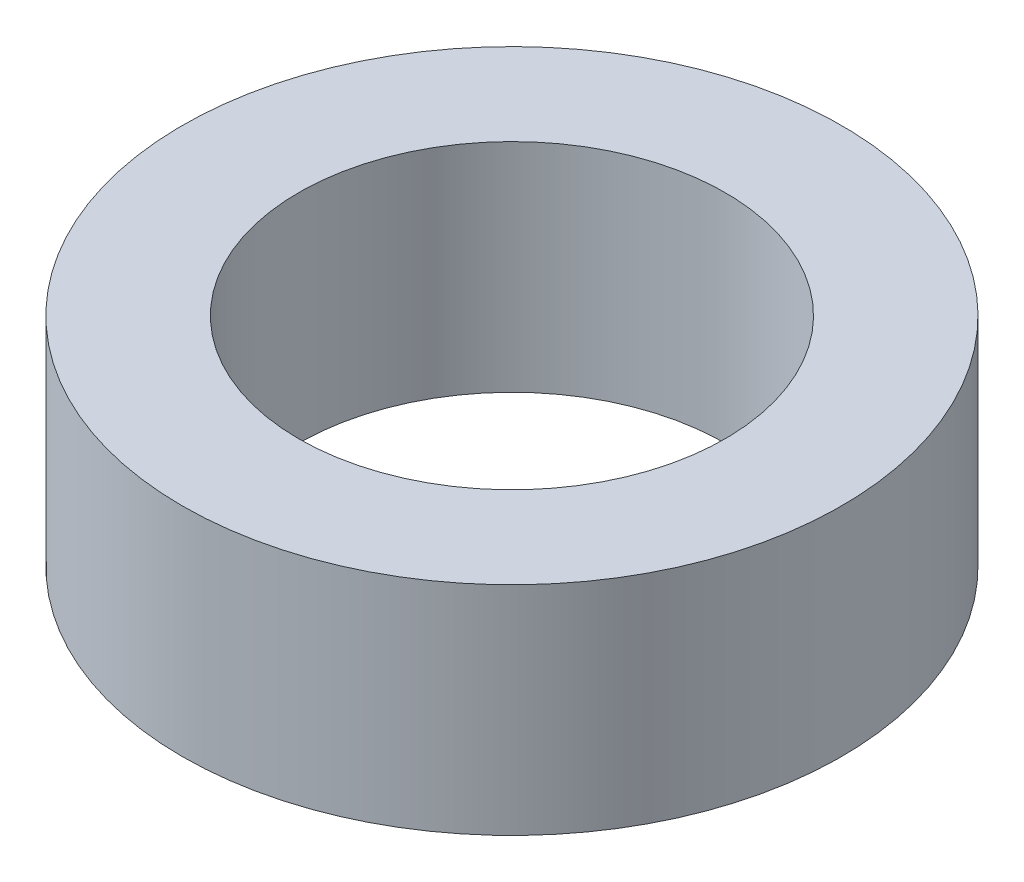
ISO-10303-21;
HEADER;
FILE_DESCRIPTION(('STEP AP214'),'2;1');
FILE_NAME('part.step','',(''),(''),'','','');
FILE_SCHEMA(('AUTOMOTIVE_DESIGN { 1 0 10303 214 1 1 1 1 }'));
ENDSEC;
DATA;
#1=APPLICATION_CONTEXT('core data for automotive mechanical design processes');
#2=APPLICATION_PROTOCOL_DEFINITION('international standard','automotive_design',2000,#1);
#3=PRODUCT_CONTEXT('',#1,'mechanical');
#4=PRODUCT('Part','Part','',(#3));
#5=PRODUCT_RELATED_PRODUCT_CATEGORY('part','',(#4));
#6=PRODUCT_DEFINITION_FORMATION('','',#4);
#7=PRODUCT_DEFINITION_CONTEXT('part definition',#1,'design');
#8=PRODUCT_DEFINITION('design','',#6,#7);
#9=PRODUCT_DEFINITION_SHAPE('','',#8);
#10=(LENGTH_UNIT() NAMED_UNIT(*) SI_UNIT(.MILLI.,.METRE.));
#11=(NAMED_UNIT(*) PLANE_ANGLE_UNIT() SI_UNIT($,.RADIAN.));
#12=(NAMED_UNIT(*) SI_UNIT($,.STERADIAN.) SOLID_ANGLE_UNIT());
#13=UNCERTAINTY_MEASURE_WITH_UNIT(LENGTH_MEASURE(1.E-05),#10,'distance_accuracy_value','');
#14=(GEOMETRIC_REPRESENTATION_CONTEXT(3) GLOBAL_UNCERTAINTY_ASSIGNED_CONTEXT((#13)) GLOBAL_UNIT_ASSIGNED_CONTEXT((#10,
#11,#12)) REPRESENTATION_CONTEXT('',''));
#15=CARTESIAN_POINT('',(0.,0.,0.));
#16=DIRECTION('',(0.,0.,1.));
#17=DIRECTION('',(1.,0.,0.));
#18=AXIS2_PLACEMENT_3D('',#15,#16,#17);
#19=CARTESIAN_POINT('',(0.,28.,0.));
#20=DIRECTION('',(0.,-1.,0.));
#21=DIRECTION('',(0.,0.,-1.));
#22=AXIS2_PLACEMENT_3D('',#19,#20,#21);
#23=CYLINDRICAL_SURFACE('',#22,42.5);
#24=CARTESIAN_POINT('',(0.,28.,0.));
#25=DIRECTION('',(0.,1.,0.));
#26=DIRECTION('',(0.,0.,1.));
#27=AXIS2_PLACEMENT_3D('',#24,#25,#26);
#28=CIRCLE('',#27,42.5);
#29=CARTESIAN_POINT('',(0.,28.,42.5));
#30=VERTEX_POINT('',#29);
#31=EDGE_CURVE('E10',#30,#30,#28,.T.);
#32=ORIENTED_EDGE('',*,*,#31,.F.);
#33=EDGE_LOOP('',(#32));
#34=FACE_BOUND('',#33,.T.);
#35=CARTESIAN_POINT('',(0.,0.,0.));
#36=DIRECTION('',(0.,1.,0.));
#37=DIRECTION('',(0.,0.,1.));
#38=AXIS2_PLACEMENT_3D('',#35,#36,#37);
#39=CIRCLE('',#38,42.5);
#40=CARTESIAN_POINT('',(0.,0.,42.5));
#41=VERTEX_POINT('',#40);
#42=EDGE_CURVE('E37',#41,#41,#39,.T.);
#43=ORIENTED_EDGE('',*,*,#42,.T.);
#44=EDGE_LOOP('',(#43));
#45=FACE_BOUND('',#44,.T.);
#46=ADVANCED_FACE('F40',(#34,#45),#23,.T.);
#47=CARTESIAN_POINT('',(0.,28.,0.));
#48=DIRECTION('',(0.,1.,0.));
#49=DIRECTION('',(0.,0.,1.));
#50=AXIS2_PLACEMENT_3D('',#47,#48,#49);
#51=PLANE('',#50);
#52=CARTESIAN_POINT('',(0.,28.,0.));
#53=DIRECTION('',(0.,1.,0.));
#54=DIRECTION('',(0.,0.,1.));
#55=AXIS2_PLACEMENT_3D('',#52,#53,#54);
#56=CIRCLE('',#55,27.5);
#57=CARTESIAN_POINT('',(0.,28.,27.5));
#58=VERTEX_POINT('',#57);
#59=EDGE_CURVE('E50',#58,#58,#56,.T.);
#60=ORIENTED_EDGE('',*,*,#59,.F.);
#61=EDGE_LOOP('',(#60));
#62=FACE_BOUND('',#61,.T.);
#63=ORIENTED_EDGE('',*,*,#31,.T.);
#64=EDGE_LOOP('',(#63));
#65=FACE_BOUND('',#64,.T.);
#66=ADVANCED_FACE('F59',(#62,#65),#51,.T.);
#67=CARTESIAN_POINT('',(0.,0.,0.));
#68=DIRECTION('',(0.,1.,0.));
#69=DIRECTION('',(0.,0.,1.));
#70=AXIS2_PLACEMENT_3D('',#67,#68,#69);
#71=PLANE('',#70);
#72=CARTESIAN_POINT('',(0.,0.,0.));
#73=DIRECTION('',(0.,1.,0.));
#74=DIRECTION('',(0.,0.,1.));
#75=AXIS2_PLACEMENT_3D('',#72,#73,#74);
#76=CIRCLE('',#75,27.5);
#77=CARTESIAN_POINT('',(0.,0.,27.5));
#78=VERTEX_POINT('',#77);
#79=EDGE_CURVE('E47',#78,#78,#76,.T.);
#80=ORIENTED_EDGE('',*,*,#79,.T.);
#81=EDGE_LOOP('',(#80));
#82=FACE_BOUND('',#81,.T.);
#83=ORIENTED_EDGE('',*,*,#42,.F.);
#84=EDGE_LOOP('',(#83));
#85=FACE_BOUND('',#84,.T.);
#86=ADVANCED_FACE('F58',(#82,#85),#71,.F.);
#87=CARTESIAN_POINT('',(0.,28.,0.));
#88=DIRECTION('',(0.,-1.,0.));
#89=DIRECTION('',(0.,0.,-1.));
#90=AXIS2_PLACEMENT_3D('',#87,#88,#89);
#91=CYLINDRICAL_SURFACE('',#90,27.5);
#92=ORIENTED_EDGE('',*,*,#59,.T.);
#93=EDGE_LOOP('',(#92));
#94=FACE_BOUND('',#93,.T.);
#95=ORIENTED_EDGE('',*,*,#79,.F.);
#96=EDGE_LOOP('',(#95));
#97=FACE_BOUND('',#96,.T.);
#98=ADVANCED_FACE('F54',(#94,#97),#91,.F.);
#99=CLOSED_SHELL('',(#46,#66,#86,#98));
#100=MANIFOLD_SOLID_BREP('B2',#99);
#101=ADVANCED_BREP_SHAPE_REPRESENTATION('',(#18,#100),#14);
#102=SHAPE_DEFINITION_REPRESENTATION(#9,#101);
ENDSEC;
END-ISO-10303-21;
